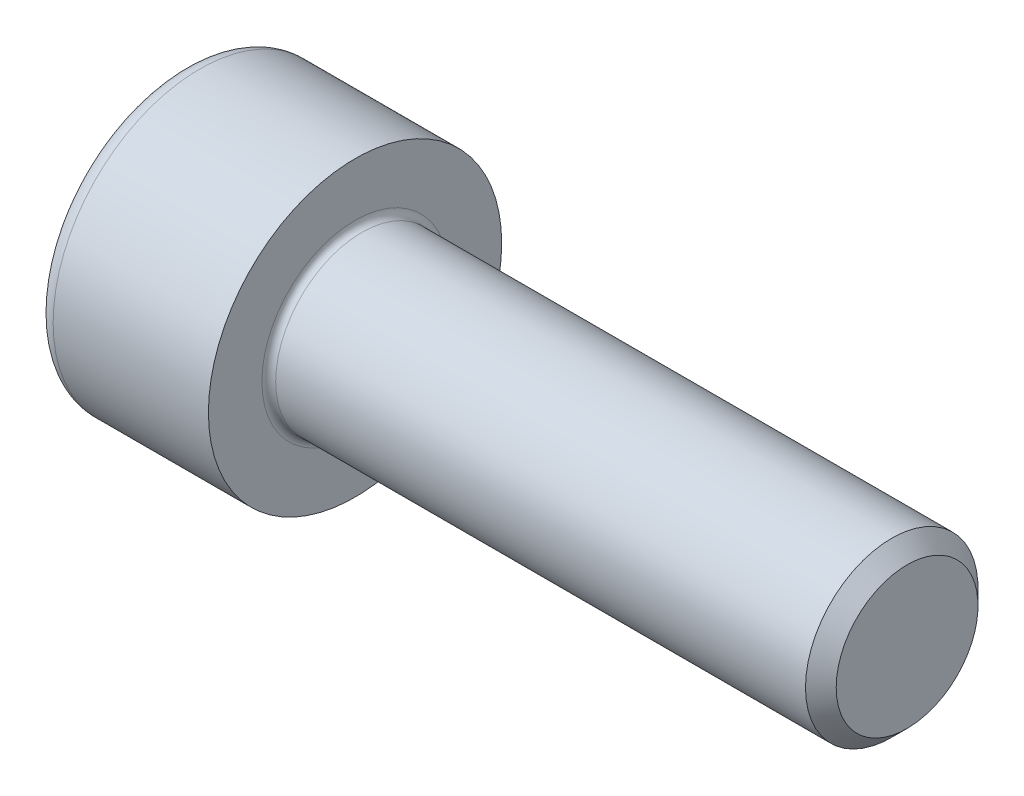
ISO-10303-21;
HEADER;
FILE_DESCRIPTION(('STEP AP214'),'2;1');
FILE_NAME('part.step','',(''),(''),'','','');
FILE_SCHEMA(('AUTOMOTIVE_DESIGN { 1 0 10303 214 1 1 1 1 }'));
ENDSEC;
DATA;
#1=APPLICATION_CONTEXT('core data for automotive mechanical design processes');
#2=APPLICATION_PROTOCOL_DEFINITION('international standard','automotive_design',2000,#1);
#3=PRODUCT_CONTEXT('',#1,'mechanical');
#4=PRODUCT('Part','Part','',(#3));
#5=PRODUCT_RELATED_PRODUCT_CATEGORY('part','',(#4));
#6=PRODUCT_DEFINITION_FORMATION('','',#4);
#7=PRODUCT_DEFINITION_CONTEXT('part definition',#1,'design');
#8=PRODUCT_DEFINITION('design','',#6,#7);
#9=PRODUCT_DEFINITION_SHAPE('','',#8);
#10=(LENGTH_UNIT() NAMED_UNIT(*) SI_UNIT(.MILLI.,.METRE.));
#11=(NAMED_UNIT(*) PLANE_ANGLE_UNIT() SI_UNIT($,.RADIAN.));
#12=(NAMED_UNIT(*) SI_UNIT($,.STERADIAN.) SOLID_ANGLE_UNIT());
#13=UNCERTAINTY_MEASURE_WITH_UNIT(LENGTH_MEASURE(1.E-05),#10,'distance_accuracy_value','');
#14=(GEOMETRIC_REPRESENTATION_CONTEXT(3) GLOBAL_UNCERTAINTY_ASSIGNED_CONTEXT((#13)) GLOBAL_UNIT_ASSIGNED_CONTEXT((#10,
#11,#12)) REPRESENTATION_CONTEXT('',''));
#15=CARTESIAN_POINT('',(0.,0.,0.));
#16=DIRECTION('',(0.,0.,1.));
#17=DIRECTION('',(1.,0.,0.));
#18=AXIS2_PLACEMENT_3D('',#15,#16,#17);
#19=CARTESIAN_POINT('',(0.,0.,0.));
#20=DIRECTION('',(-1.,0.,0.));
#21=DIRECTION('',(0.,0.,1.));
#22=AXIS2_PLACEMENT_3D('',#19,#20,#21);
#23=PLANE('',#22);
#24=DIRECTION('',(0.,-0.499999999999998,0.86602540378444));
#25=VECTOR('',#24,1.);
#26=CARTESIAN_POINT('',(0.,2.32094808214229,0.));
#27=LINE('',#26,#25);
#28=CARTESIAN_POINT('',(0.,2.32094808214229,0.));
#29=VERTEX_POINT('',#28);
#30=CARTESIAN_POINT('',(0.,1.16047404107115,2.01));
#31=VERTEX_POINT('',#30);
#32=EDGE_CURVE('E268',#29,#31,#27,.T.);
#33=ORIENTED_EDGE('',*,*,#32,.T.);
#34=DIRECTION('',(0.,1.,0.));
#35=VECTOR('',#34,1.);
#36=CARTESIAN_POINT('',(0.,-1.16047404107115,2.01));
#37=LINE('',#36,#35);
#38=CARTESIAN_POINT('',(0.,-1.16047404107115,2.01));
#39=VERTEX_POINT('',#38);
#40=EDGE_CURVE('E129',#39,#31,#37,.T.);
#41=ORIENTED_EDGE('',*,*,#40,.F.);
#42=DIRECTION('',(0.,-0.500000000000001,-0.866025403784438));
#43=VECTOR('',#42,1.);
#44=CARTESIAN_POINT('',(0.,-1.16047404107115,2.01));
#45=LINE('',#44,#43);
#46=CARTESIAN_POINT('',(0.,-2.3209480821423,0.));
#47=VERTEX_POINT('',#46);
#48=EDGE_CURVE('E271',#39,#47,#45,.T.);
#49=ORIENTED_EDGE('',*,*,#48,.T.);
#50=DIRECTION('',(0.,0.499999999999998,-0.86602540378444));
#51=VECTOR('',#50,1.);
#52=CARTESIAN_POINT('',(0.,-2.3209480821423,0.));
#53=LINE('',#52,#51);
#54=CARTESIAN_POINT('',(0.,-1.16047404107116,-2.01));
#55=VERTEX_POINT('',#54);
#56=EDGE_CURVE('E274',#47,#55,#53,.T.);
#57=ORIENTED_EDGE('',*,*,#56,.T.);
#58=DIRECTION('',(0.,-1.,0.));
#59=VECTOR('',#58,1.);
#60=CARTESIAN_POINT('',(0.,1.16047404107114,-2.01));
#61=LINE('',#60,#59);
#62=CARTESIAN_POINT('',(0.,1.16047404107114,-2.01));
#63=VERTEX_POINT('',#62);
#64=EDGE_CURVE('E277',#63,#55,#61,.T.);
#65=ORIENTED_EDGE('',*,*,#64,.F.);
#66=DIRECTION('',(0.,-0.500000000000001,-0.866025403784438));
#67=VECTOR('',#66,1.);
#68=CARTESIAN_POINT('',(0.,2.32094808214229,0.));
#69=LINE('',#68,#67);
#70=EDGE_CURVE('E124',#29,#63,#69,.T.);
#71=ORIENTED_EDGE('',*,*,#70,.F.);
#72=EDGE_LOOP('',(#33,#41,#49,#57,#65,#71));
#73=FACE_BOUND('',#72,.T.);
#74=CARTESIAN_POINT('',(0.,0.,0.));
#75=DIRECTION('',(-1.,0.,0.));
#76=DIRECTION('',(0.,0.,1.));
#77=AXIS2_PLACEMENT_3D('',#74,#75,#76);
#78=CIRCLE('',#77,3.75);
#79=CARTESIAN_POINT('',(0.,0.,3.75));
#80=VERTEX_POINT('',#79);
#81=EDGE_CURVE('E45',#80,#80,#78,.T.);
#82=ORIENTED_EDGE('',*,*,#81,.T.);
#83=EDGE_LOOP('',(#82));
#84=FACE_BOUND('',#83,.T.);
#85=ADVANCED_FACE('F37',(#73,#84),#23,.T.);
#86=CARTESIAN_POINT('',(-31.75,0.,0.));
#87=DIRECTION('',(-1.,0.,0.));
#88=DIRECTION('',(0.,0.,1.));
#89=AXIS2_PLACEMENT_3D('',#86,#87,#88);
#90=CYLINDRICAL_SURFACE('',#89,4.25);
#91=CARTESIAN_POINT('',(0.5,0.,0.));
#92=DIRECTION('',(-1.,0.,0.));
#93=DIRECTION('',(0.,0.,1.));
#94=AXIS2_PLACEMENT_3D('',#91,#92,#93);
#95=CIRCLE('',#94,4.25);
#96=CARTESIAN_POINT('',(0.5,0.,4.25));
#97=VERTEX_POINT('',#96);
#98=EDGE_CURVE('E11',#97,#97,#95,.F.);
#99=ORIENTED_EDGE('',*,*,#98,.T.);
#100=EDGE_LOOP('',(#99));
#101=FACE_BOUND('',#100,.T.);
#102=CARTESIAN_POINT('',(5.,0.,0.));
#103=DIRECTION('',(-1.,0.,0.));
#104=DIRECTION('',(0.,0.,1.));
#105=AXIS2_PLACEMENT_3D('',#102,#103,#104);
#106=CIRCLE('',#105,4.25);
#107=CARTESIAN_POINT('',(5.,0.,4.25));
#108=VERTEX_POINT('',#107);
#109=EDGE_CURVE('E147',#108,#108,#106,.T.);
#110=ORIENTED_EDGE('',*,*,#109,.T.);
#111=EDGE_LOOP('',(#110));
#112=FACE_BOUND('',#111,.T.);
#113=ADVANCED_FACE('F171',(#101,#112),#90,.T.);
#114=CARTESIAN_POINT('',(5.,4.25,0.));
#115=DIRECTION('',(1.,0.,0.));
#116=DIRECTION('',(0.,0.,-1.));
#117=AXIS2_PLACEMENT_3D('',#114,#115,#116);
#118=PLANE('',#117);
#119=CARTESIAN_POINT('',(5.,0.,0.));
#120=DIRECTION('',(1.,0.,0.));
#121=DIRECTION('',(0.,0.,-1.));
#122=AXIS2_PLACEMENT_3D('',#119,#120,#121);
#123=CIRCLE('',#122,2.7);
#124=CARTESIAN_POINT('',(5.,0.,-2.7));
#125=VERTEX_POINT('',#124);
#126=EDGE_CURVE('E150',#125,#125,#123,.F.);
#127=ORIENTED_EDGE('',*,*,#126,.T.);
#128=EDGE_LOOP('',(#127));
#129=FACE_BOUND('',#128,.T.);
#130=ORIENTED_EDGE('',*,*,#109,.F.);
#131=EDGE_LOOP('',(#130));
#132=FACE_BOUND('',#131,.T.);
#133=ADVANCED_FACE('F177',(#129,#132),#118,.T.);
#134=CARTESIAN_POINT('',(-31.75,0.,0.));
#135=DIRECTION('',(-1.,0.,0.));
#136=DIRECTION('',(0.,0.,1.));
#137=AXIS2_PLACEMENT_3D('',#134,#135,#136);
#138=CYLINDRICAL_SURFACE('',#137,2.5);
#139=CARTESIAN_POINT('',(5.2,0.,0.));
#140=DIRECTION('',(1.,0.,0.));
#141=DIRECTION('',(0.,0.,-1.));
#142=AXIS2_PLACEMENT_3D('',#139,#140,#141);
#143=CIRCLE('',#142,2.5);
#144=CARTESIAN_POINT('',(5.2,0.,-2.5));
#145=VERTEX_POINT('',#144);
#146=EDGE_CURVE('E153',#145,#145,#143,.T.);
#147=ORIENTED_EDGE('',*,*,#146,.T.);
#148=EDGE_LOOP('',(#147));
#149=FACE_BOUND('',#148,.T.);
#150=CARTESIAN_POINT('',(20.555,0.,0.));
#151=DIRECTION('',(-1.,0.,0.));
#152=DIRECTION('',(0.,0.,1.));
#153=AXIS2_PLACEMENT_3D('',#150,#151,#152);
#154=CIRCLE('',#153,2.5);
#155=CARTESIAN_POINT('',(20.555,0.,2.5));
#156=VERTEX_POINT('',#155);
#157=EDGE_CURVE('E144',#156,#156,#154,.T.);
#158=ORIENTED_EDGE('',*,*,#157,.T.);
#159=EDGE_LOOP('',(#158));
#160=FACE_BOUND('',#159,.T.);
#161=ADVANCED_FACE('F183',(#149,#160),#138,.T.);
#162=CARTESIAN_POINT('',(21.,0.,0.));
#163=DIRECTION('',(-1.,0.,0.));
#164=DIRECTION('',(0.,0.,1.));
#165=AXIS2_PLACEMENT_3D('',#162,#163,#164);
#166=CONICAL_SURFACE('',#165,2.055,0.785398163397454);
#167=ORIENTED_EDGE('',*,*,#157,.F.);
#168=EDGE_LOOP('',(#167));
#169=FACE_BOUND('',#168,.T.);
#170=CARTESIAN_POINT('',(21.,0.,0.));
#171=DIRECTION('',(-1.,0.,0.));
#172=DIRECTION('',(0.,0.,1.));
#173=AXIS2_PLACEMENT_3D('',#170,#171,#172);
#174=CIRCLE('',#173,2.055);
#175=CARTESIAN_POINT('',(21.,0.,2.055));
#176=VERTEX_POINT('',#175);
#177=EDGE_CURVE('E140',#176,#176,#174,.T.);
#178=ORIENTED_EDGE('',*,*,#177,.T.);
#179=EDGE_LOOP('',(#178));
#180=FACE_BOUND('',#179,.T.);
#181=ADVANCED_FACE('F187',(#169,#180),#166,.T.);
#182=CARTESIAN_POINT('',(21.,2.055,0.));
#183=DIRECTION('',(1.,0.,0.));
#184=DIRECTION('',(0.,0.,-1.));
#185=AXIS2_PLACEMENT_3D('',#182,#183,#184);
#186=PLANE('',#185);
#187=ORIENTED_EDGE('',*,*,#177,.F.);
#188=EDGE_LOOP('',(#187));
#189=FACE_BOUND('',#188,.T.);
#190=ADVANCED_FACE('F167',(#189),#186,.T.);
#191=CARTESIAN_POINT('',(5.2,0.,0.));
#192=DIRECTION('',(1.,0.,0.));
#193=DIRECTION('',(0.,0.,-1.));
#194=AXIS2_PLACEMENT_3D('',#191,#192,#193);
#195=TOROIDAL_SURFACE('',#194,2.7,0.2);
#196=ORIENTED_EDGE('',*,*,#146,.F.);
#197=EDGE_LOOP('',(#196));
#198=FACE_BOUND('',#197,.T.);
#199=ORIENTED_EDGE('',*,*,#126,.F.);
#200=EDGE_LOOP('',(#199));
#201=FACE_BOUND('',#200,.T.);
#202=ADVANCED_FACE('F160',(#198,#201),#195,.F.);
#203=CARTESIAN_POINT('',(0.5,0.,0.));
#204=DIRECTION('',(-1.,0.,0.));
#205=DIRECTION('',(0.,0.,1.));
#206=AXIS2_PLACEMENT_3D('',#203,#204,#205);
#207=TOROIDAL_SURFACE('',#206,3.75,0.5);
#208=ORIENTED_EDGE('',*,*,#98,.F.);
#209=EDGE_LOOP('',(#208));
#210=FACE_BOUND('',#209,.T.);
#211=ORIENTED_EDGE('',*,*,#81,.F.);
#212=EDGE_LOOP('',(#211));
#213=FACE_BOUND('',#212,.T.);
#214=ADVANCED_FACE('F39',(#210,#213),#207,.T.);
#215=CARTESIAN_POINT('',(2.5,2.32094808214229,0.));
#216=DIRECTION('',(0.,-0.86602540378444,-0.499999999999998));
#217=DIRECTION('',(0.,0.499999999999998,-0.86602540378444));
#218=AXIS2_PLACEMENT_3D('',#215,#216,#217);
#219=PLANE('',#218);
#220=ORIENTED_EDGE('',*,*,#32,.F.);
#221=DIRECTION('',(-1.,0.,0.));
#222=VECTOR('',#221,1.);
#223=CARTESIAN_POINT('',(2.5,2.32094808214229,0.));
#224=LINE('',#223,#222);
#225=CARTESIAN_POINT('',(2.5,2.32094808214229,0.));
#226=VERTEX_POINT('',#225);
#227=EDGE_CURVE('E267',#226,#29,#224,.T.);
#228=ORIENTED_EDGE('',*,*,#227,.F.);
#229=DIRECTION('',(0.,-0.499999999999998,0.86602540378444));
#230=VECTOR('',#229,1.);
#231=CARTESIAN_POINT('',(2.5,2.32094808214229,0.));
#232=LINE('',#231,#230);
#233=CARTESIAN_POINT('',(2.5,1.74071106160672,1.005));
#234=VERTEX_POINT('',#233);
#235=EDGE_CURVE('E52',#226,#234,#232,.T.);
#236=ORIENTED_EDGE('',*,*,#235,.T.);
#237=CARTESIAN_POINT('',(2.5,1.16047404107115,2.01));
#238=VERTEX_POINT('',#237);
#239=EDGE_CURVE('E110',#234,#238,#232,.T.);
#240=ORIENTED_EDGE('',*,*,#239,.T.);
#241=DIRECTION('',(-1.,0.,0.));
#242=VECTOR('',#241,1.);
#243=CARTESIAN_POINT('',(2.5,1.16047404107115,2.01));
#244=LINE('',#243,#242);
#245=EDGE_CURVE('E122',#238,#31,#244,.T.);
#246=ORIENTED_EDGE('',*,*,#245,.T.);
#247=EDGE_LOOP('',(#220,#228,#236,#240,#246));
#248=FACE_BOUND('',#247,.T.);
#249=ADVANCED_FACE('F121',(#248),#219,.T.);
#250=CARTESIAN_POINT('',(2.5,-1.16047404107115,2.01));
#251=DIRECTION('',(0.,0.,1.));
#252=DIRECTION('',(0.,-1.,0.));
#253=AXIS2_PLACEMENT_3D('',#250,#251,#252);
#254=PLANE('',#253);
#255=ORIENTED_EDGE('',*,*,#40,.T.);
#256=ORIENTED_EDGE('',*,*,#245,.F.);
#257=DIRECTION('',(0.,1.,0.));
#258=VECTOR('',#257,1.);
#259=CARTESIAN_POINT('',(2.5,-1.16047404107115,2.01));
#260=LINE('',#259,#258);
#261=CARTESIAN_POINT('',(2.5,0.,2.01));
#262=VERTEX_POINT('',#261);
#263=EDGE_CURVE('E108',#262,#238,#260,.T.);
#264=ORIENTED_EDGE('',*,*,#263,.F.);
#265=CARTESIAN_POINT('',(2.5,-1.16047404107115,2.01));
#266=VERTEX_POINT('',#265);
#267=EDGE_CURVE('E118',#266,#262,#260,.T.);
#268=ORIENTED_EDGE('',*,*,#267,.F.);
#269=DIRECTION('',(-1.,0.,0.));
#270=VECTOR('',#269,1.);
#271=CARTESIAN_POINT('',(2.5,-1.16047404107115,2.01));
#272=LINE('',#271,#270);
#273=EDGE_CURVE('E131',#266,#39,#272,.T.);
#274=ORIENTED_EDGE('',*,*,#273,.T.);
#275=EDGE_LOOP('',(#255,#256,#264,#268,#274));
#276=FACE_BOUND('',#275,.T.);
#277=ADVANCED_FACE('F126',(#276),#254,.F.);
#278=CARTESIAN_POINT('',(2.5,-1.16047404107115,2.01));
#279=DIRECTION('',(0.,0.866025403784438,-0.500000000000001));
#280=DIRECTION('',(0.,0.500000000000001,0.866025403784438));
#281=AXIS2_PLACEMENT_3D('',#278,#279,#280);
#282=PLANE('',#281);
#283=ORIENTED_EDGE('',*,*,#48,.F.);
#284=ORIENTED_EDGE('',*,*,#273,.F.);
#285=DIRECTION('',(0.,-0.500000000000001,-0.866025403784438));
#286=VECTOR('',#285,1.);
#287=CARTESIAN_POINT('',(2.5,-1.16047404107115,2.01));
#288=LINE('',#287,#286);
#289=CARTESIAN_POINT('',(2.5,-1.74071106160672,1.005));
#290=VERTEX_POINT('',#289);
#291=EDGE_CURVE('E248',#266,#290,#288,.T.);
#292=ORIENTED_EDGE('',*,*,#291,.T.);
#293=CARTESIAN_POINT('',(2.5,-2.3209480821423,0.));
#294=VERTEX_POINT('',#293);
#295=EDGE_CURVE('E250',#290,#294,#288,.T.);
#296=ORIENTED_EDGE('',*,*,#295,.T.);
#297=DIRECTION('',(-1.,0.,0.));
#298=VECTOR('',#297,1.);
#299=CARTESIAN_POINT('',(2.5,-2.3209480821423,0.));
#300=LINE('',#299,#298);
#301=EDGE_CURVE('E136',#294,#47,#300,.T.);
#302=ORIENTED_EDGE('',*,*,#301,.T.);
#303=EDGE_LOOP('',(#283,#284,#292,#296,#302));
#304=FACE_BOUND('',#303,.T.);
#305=ADVANCED_FACE('F200',(#304),#282,.T.);
#306=CARTESIAN_POINT('',(2.5,-2.3209480821423,0.));
#307=DIRECTION('',(0.,0.86602540378444,0.499999999999998));
#308=DIRECTION('',(0.,-0.499999999999998,0.86602540378444));
#309=AXIS2_PLACEMENT_3D('',#306,#307,#308);
#310=PLANE('',#309);
#311=ORIENTED_EDGE('',*,*,#56,.F.);
#312=ORIENTED_EDGE('',*,*,#301,.F.);
#313=DIRECTION('',(0.,0.499999999999998,-0.86602540378444));
#314=VECTOR('',#313,1.);
#315=CARTESIAN_POINT('',(2.5,-2.3209480821423,0.));
#316=LINE('',#315,#314);
#317=CARTESIAN_POINT('',(2.5,-1.74071106160673,-1.005));
#318=VERTEX_POINT('',#317);
#319=EDGE_CURVE('E253',#294,#318,#316,.T.);
#320=ORIENTED_EDGE('',*,*,#319,.T.);
#321=CARTESIAN_POINT('',(2.5,-1.16047404107116,-2.01));
#322=VERTEX_POINT('',#321);
#323=EDGE_CURVE('E257',#318,#322,#316,.T.);
#324=ORIENTED_EDGE('',*,*,#323,.T.);
#325=DIRECTION('',(-1.,0.,0.));
#326=VECTOR('',#325,1.);
#327=CARTESIAN_POINT('',(2.5,-1.16047404107116,-2.01));
#328=LINE('',#327,#326);
#329=EDGE_CURVE('E286',#322,#55,#328,.T.);
#330=ORIENTED_EDGE('',*,*,#329,.T.);
#331=EDGE_LOOP('',(#311,#312,#320,#324,#330));
#332=FACE_BOUND('',#331,.T.);
#333=ADVANCED_FACE('F203',(#332),#310,.T.);
#334=CARTESIAN_POINT('',(2.5,1.16047404107114,-2.01));
#335=DIRECTION('',(0.,0.,-1.));
#336=DIRECTION('',(0.,1.,0.));
#337=AXIS2_PLACEMENT_3D('',#334,#335,#336);
#338=PLANE('',#337);
#339=ORIENTED_EDGE('',*,*,#64,.T.);
#340=ORIENTED_EDGE('',*,*,#329,.F.);
#341=DIRECTION('',(0.,-1.,0.));
#342=VECTOR('',#341,1.);
#343=CARTESIAN_POINT('',(2.5,1.16047404107114,-2.01));
#344=LINE('',#343,#342);
#345=CARTESIAN_POINT('',(2.5,0.,-2.01));
#346=VERTEX_POINT('',#345);
#347=EDGE_CURVE('E261',#346,#322,#344,.T.);
#348=ORIENTED_EDGE('',*,*,#347,.F.);
#349=CARTESIAN_POINT('',(2.5,1.16047404107114,-2.01));
#350=VERTEX_POINT('',#349);
#351=EDGE_CURVE('E262',#350,#346,#344,.T.);
#352=ORIENTED_EDGE('',*,*,#351,.F.);
#353=DIRECTION('',(-1.,0.,0.));
#354=VECTOR('',#353,1.);
#355=CARTESIAN_POINT('',(2.5,1.16047404107114,-2.01));
#356=LINE('',#355,#354);
#357=EDGE_CURVE('E283',#350,#63,#356,.T.);
#358=ORIENTED_EDGE('',*,*,#357,.T.);
#359=EDGE_LOOP('',(#339,#340,#348,#352,#358));
#360=FACE_BOUND('',#359,.T.);
#361=ADVANCED_FACE('F207',(#360),#338,.F.);
#362=CARTESIAN_POINT('',(2.5,2.32094808214229,0.));
#363=DIRECTION('',(0.,0.866025403784438,-0.500000000000001));
#364=DIRECTION('',(0.,0.500000000000001,0.866025403784438));
#365=AXIS2_PLACEMENT_3D('',#362,#363,#364);
#366=PLANE('',#365);
#367=ORIENTED_EDGE('',*,*,#70,.T.);
#368=ORIENTED_EDGE('',*,*,#357,.F.);
#369=DIRECTION('',(0.,-0.500000000000001,-0.866025403784438));
#370=VECTOR('',#369,1.);
#371=CARTESIAN_POINT('',(2.5,2.32094808214229,0.));
#372=LINE('',#371,#370);
#373=CARTESIAN_POINT('',(2.5,1.74071106160672,-1.005));
#374=VERTEX_POINT('',#373);
#375=EDGE_CURVE('E265',#374,#350,#372,.T.);
#376=ORIENTED_EDGE('',*,*,#375,.F.);
#377=EDGE_CURVE('E239',#226,#374,#372,.T.);
#378=ORIENTED_EDGE('',*,*,#377,.F.);
#379=ORIENTED_EDGE('',*,*,#227,.T.);
#380=EDGE_LOOP('',(#367,#368,#376,#378,#379));
#381=FACE_BOUND('',#380,.T.);
#382=ADVANCED_FACE('F211',(#381),#366,.F.);
#383=CARTESIAN_POINT('',(2.5,1.16047404107115,2.01));
#384=DIRECTION('',(-1.,0.,0.));
#385=DIRECTION('',(0.,0.,1.));
#386=AXIS2_PLACEMENT_3D('',#383,#384,#385);
#387=PLANE('',#386);
#388=CARTESIAN_POINT('',(2.5,0.,0.));
#389=DIRECTION('',(-1.,0.,0.));
#390=DIRECTION('',(0.,0.,1.));
#391=AXIS2_PLACEMENT_3D('',#388,#389,#390);
#392=CIRCLE('',#391,2.01);
#393=EDGE_CURVE('E130',#290,#262,#392,.T.);
#394=ORIENTED_EDGE('',*,*,#393,.F.);
#395=ORIENTED_EDGE('',*,*,#291,.F.);
#396=ORIENTED_EDGE('',*,*,#267,.T.);
#397=EDGE_LOOP('',(#394,#395,#396));
#398=FACE_BOUND('',#397,.T.);
#399=ADVANCED_FACE('F215',(#398),#387,.T.);
#400=EDGE_CURVE('E134',#318,#290,#392,.T.);
#401=ORIENTED_EDGE('',*,*,#400,.F.);
#402=ORIENTED_EDGE('',*,*,#319,.F.);
#403=ORIENTED_EDGE('',*,*,#295,.F.);
#404=EDGE_LOOP('',(#401,#402,#403));
#405=FACE_BOUND('',#404,.T.);
#406=ADVANCED_FACE('F218',(#405),#387,.T.);
#407=EDGE_CURVE('E292',#346,#318,#392,.T.);
#408=ORIENTED_EDGE('',*,*,#407,.F.);
#409=ORIENTED_EDGE('',*,*,#347,.T.);
#410=ORIENTED_EDGE('',*,*,#323,.F.);
#411=EDGE_LOOP('',(#408,#409,#410));
#412=FACE_BOUND('',#411,.T.);
#413=ADVANCED_FACE('F223',(#412),#387,.T.);
#414=EDGE_CURVE('E242',#374,#346,#392,.T.);
#415=ORIENTED_EDGE('',*,*,#414,.F.);
#416=ORIENTED_EDGE('',*,*,#375,.T.);
#417=ORIENTED_EDGE('',*,*,#351,.T.);
#418=EDGE_LOOP('',(#415,#416,#417));
#419=FACE_BOUND('',#418,.T.);
#420=ADVANCED_FACE('F230',(#419),#387,.T.);
#421=EDGE_CURVE('E141',#234,#374,#392,.T.);
#422=ORIENTED_EDGE('',*,*,#421,.F.);
#423=ORIENTED_EDGE('',*,*,#235,.F.);
#424=ORIENTED_EDGE('',*,*,#377,.T.);
#425=EDGE_LOOP('',(#422,#423,#424));
#426=FACE_BOUND('',#425,.T.);
#427=ADVANCED_FACE('F226',(#426),#387,.T.);
#428=EDGE_CURVE('E113',#262,#234,#392,.T.);
#429=ORIENTED_EDGE('',*,*,#428,.F.);
#430=ORIENTED_EDGE('',*,*,#263,.T.);
#431=ORIENTED_EDGE('',*,*,#239,.F.);
#432=EDGE_LOOP('',(#429,#430,#431));
#433=FACE_BOUND('',#432,.T.);
#434=ADVANCED_FACE('F109',(#433),#387,.T.);
#435=CARTESIAN_POINT('',(2.5,0.,0.));
#436=DIRECTION('',(-1.,0.,0.));
#437=DIRECTION('',(0.,0.,1.));
#438=AXIS2_PLACEMENT_3D('',#435,#436,#437);
#439=CONICAL_SURFACE('',#438,2.01,1.04719755119659);
#440=CARTESIAN_POINT('',(3.66047404107116,0.,0.));
#441=VERTEX_POINT('',#440);
#442=VERTEX_LOOP('',#441);
#443=FACE_BOUND('',#442,.T.);
#444=ORIENTED_EDGE('',*,*,#428,.T.);
#445=ORIENTED_EDGE('',*,*,#421,.T.);
#446=ORIENTED_EDGE('',*,*,#414,.T.);
#447=ORIENTED_EDGE('',*,*,#407,.T.);
#448=ORIENTED_EDGE('',*,*,#400,.T.);
#449=ORIENTED_EDGE('',*,*,#393,.T.);
#450=EDGE_LOOP('',(#444,#445,#446,#447,#448,#449));
#451=FACE_BOUND('',#450,.T.);
#452=ADVANCED_FACE('F195',(#443,#451),#439,.F.);
#453=CLOSED_SHELL('',(#85,#113,#133,#161,#181,#190,#202,#214,#249,#277,#305,#333,#361,#382,#399,
#406,#413,#420,#427,#434,#452));
#454=MANIFOLD_SOLID_BREP('B2',#453);
#455=ADVANCED_BREP_SHAPE_REPRESENTATION('',(#18,#454),#14);
#456=SHAPE_DEFINITION_REPRESENTATION(#9,#455);
ENDSEC;
END-ISO-10303-21;
